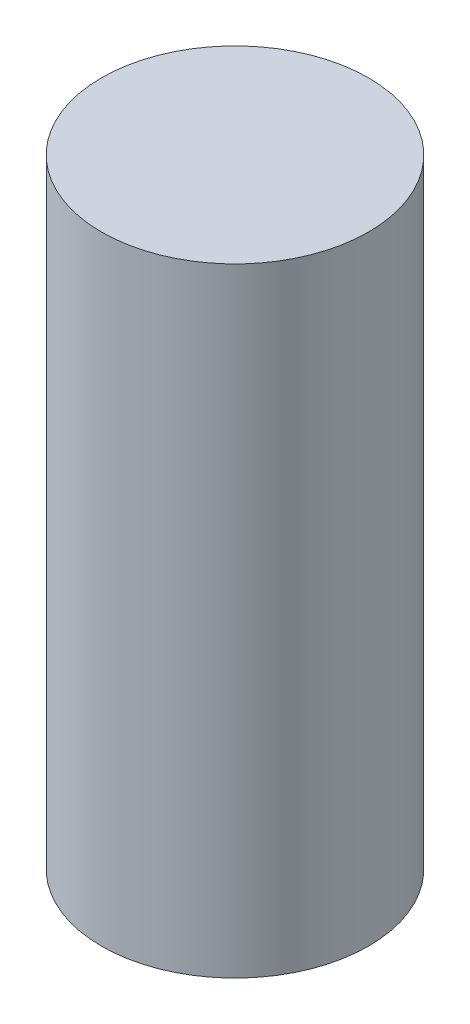
ISO-10303-21;
HEADER;
FILE_DESCRIPTION(('STEP AP214'),'2;1');
FILE_NAME('part.step','',(''),(''),'','','');
FILE_SCHEMA(('AUTOMOTIVE_DESIGN { 1 0 10303 214 1 1 1 1 }'));
ENDSEC;
DATA;
#1=APPLICATION_CONTEXT('core data for automotive mechanical design processes');
#2=APPLICATION_PROTOCOL_DEFINITION('international standard','automotive_design',2000,#1);
#3=PRODUCT_CONTEXT('',#1,'mechanical');
#4=PRODUCT('Part','Part','',(#3));
#5=PRODUCT_RELATED_PRODUCT_CATEGORY('part','',(#4));
#6=PRODUCT_DEFINITION_FORMATION('','',#4);
#7=PRODUCT_DEFINITION_CONTEXT('part definition',#1,'design');
#8=PRODUCT_DEFINITION('design','',#6,#7);
#9=PRODUCT_DEFINITION_SHAPE('','',#8);
#10=(LENGTH_UNIT() NAMED_UNIT(*) SI_UNIT(.MILLI.,.METRE.));
#11=(NAMED_UNIT(*) PLANE_ANGLE_UNIT() SI_UNIT($,.RADIAN.));
#12=(NAMED_UNIT(*) SI_UNIT($,.STERADIAN.) SOLID_ANGLE_UNIT());
#13=UNCERTAINTY_MEASURE_WITH_UNIT(LENGTH_MEASURE(1.E-05),#10,'distance_accuracy_value','');
#14=(GEOMETRIC_REPRESENTATION_CONTEXT(3) GLOBAL_UNCERTAINTY_ASSIGNED_CONTEXT((#13)) GLOBAL_UNIT_ASSIGNED_CONTEXT((#10,
#11,#12)) REPRESENTATION_CONTEXT('',''));
#15=CARTESIAN_POINT('',(0.,0.,0.));
#16=DIRECTION('',(0.,0.,1.));
#17=DIRECTION('',(1.,0.,0.));
#18=AXIS2_PLACEMENT_3D('',#15,#16,#17);
#19=CARTESIAN_POINT('',(0.,279.4,0.));
#20=DIRECTION('',(0.,-1.,0.));
#21=DIRECTION('',(0.,0.,-1.));
#22=AXIS2_PLACEMENT_3D('',#19,#20,#21);
#23=CYLINDRICAL_SURFACE('',#22,60.325);
#24=CARTESIAN_POINT('',(0.,279.4,0.));
#25=DIRECTION('',(0.,1.,0.));
#26=DIRECTION('',(0.,0.,1.));
#27=AXIS2_PLACEMENT_3D('',#24,#25,#26);
#28=CIRCLE('',#27,60.325);
#29=CARTESIAN_POINT('',(0.,279.4,60.325));
#30=VERTEX_POINT('',#29);
#31=EDGE_CURVE('E10',#30,#30,#28,.T.);
#32=ORIENTED_EDGE('',*,*,#31,.F.);
#33=EDGE_LOOP('',(#32));
#34=FACE_BOUND('',#33,.T.);
#35=CARTESIAN_POINT('',(0.,0.,0.));
#36=DIRECTION('',(0.,1.,0.));
#37=DIRECTION('',(0.,0.,1.));
#38=AXIS2_PLACEMENT_3D('',#35,#36,#37);
#39=CIRCLE('',#38,60.325);
#40=CARTESIAN_POINT('',(0.,0.,60.325));
#41=VERTEX_POINT('',#40);
#42=EDGE_CURVE('E34',#41,#41,#39,.T.);
#43=ORIENTED_EDGE('',*,*,#42,.T.);
#44=EDGE_LOOP('',(#43));
#45=FACE_BOUND('',#44,.T.);
#46=ADVANCED_FACE('F31',(#34,#45),#23,.T.);
#47=CARTESIAN_POINT('',(0.,279.4,0.));
#48=DIRECTION('',(0.,1.,0.));
#49=DIRECTION('',(0.,0.,1.));
#50=AXIS2_PLACEMENT_3D('',#47,#48,#49);
#51=PLANE('',#50);
#52=ORIENTED_EDGE('',*,*,#31,.T.);
#53=EDGE_LOOP('',(#52));
#54=FACE_BOUND('',#53,.T.);
#55=ADVANCED_FACE('F46',(#54),#51,.T.);
#56=CARTESIAN_POINT('',(0.,0.,0.));
#57=DIRECTION('',(0.,1.,0.));
#58=DIRECTION('',(0.,0.,1.));
#59=AXIS2_PLACEMENT_3D('',#56,#57,#58);
#60=PLANE('',#59);
#61=ORIENTED_EDGE('',*,*,#42,.F.);
#62=EDGE_LOOP('',(#61));
#63=FACE_BOUND('',#62,.T.);
#64=ADVANCED_FACE('F44',(#63),#60,.F.);
#65=CLOSED_SHELL('',(#46,#55,#64));
#66=MANIFOLD_SOLID_BREP('B2',#65);
#67=ADVANCED_BREP_SHAPE_REPRESENTATION('',(#18,#66),#14);
#68=SHAPE_DEFINITION_REPRESENTATION(#9,#67);
ENDSEC;
END-ISO-10303-21;
